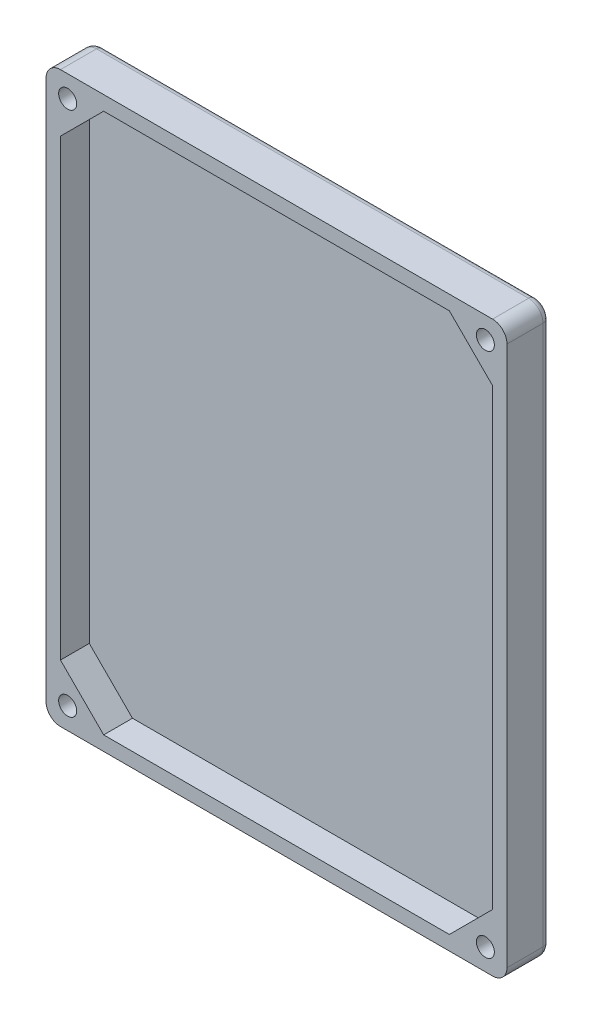
ISO-10303-21;
HEADER;
FILE_DESCRIPTION(('STEP AP214'),'2;1');
FILE_NAME('part.step','',(''),(''),'','','');
FILE_SCHEMA(('AUTOMOTIVE_DESIGN { 1 0 10303 214 1 1 1 1 }'));
ENDSEC;
DATA;
#1=APPLICATION_CONTEXT('core data for automotive mechanical design processes');
#2=APPLICATION_PROTOCOL_DEFINITION('international standard','automotive_design',2000,#1);
#3=PRODUCT_CONTEXT('',#1,'mechanical');
#4=PRODUCT('Part','Part','',(#3));
#5=PRODUCT_RELATED_PRODUCT_CATEGORY('part','',(#4));
#6=PRODUCT_DEFINITION_FORMATION('','',#4);
#7=PRODUCT_DEFINITION_CONTEXT('part definition',#1,'design');
#8=PRODUCT_DEFINITION('design','',#6,#7);
#9=PRODUCT_DEFINITION_SHAPE('','',#8);
#10=(LENGTH_UNIT() NAMED_UNIT(*) SI_UNIT(.MILLI.,.METRE.));
#11=(NAMED_UNIT(*) PLANE_ANGLE_UNIT() SI_UNIT($,.RADIAN.));
#12=(NAMED_UNIT(*) SI_UNIT($,.STERADIAN.) SOLID_ANGLE_UNIT());
#13=UNCERTAINTY_MEASURE_WITH_UNIT(LENGTH_MEASURE(1.E-05),#10,'distance_accuracy_value','');
#14=(GEOMETRIC_REPRESENTATION_CONTEXT(3) GLOBAL_UNCERTAINTY_ASSIGNED_CONTEXT((#13)) GLOBAL_UNIT_ASSIGNED_CONTEXT((#10,
#11,#12)) REPRESENTATION_CONTEXT('',''));
#15=CARTESIAN_POINT('',(0.,0.,0.));
#16=DIRECTION('',(0.,0.,1.));
#17=DIRECTION('',(1.,0.,0.));
#18=AXIS2_PLACEMENT_3D('',#15,#16,#17);
#19=CARTESIAN_POINT('',(0.,-38.5,1.));
#20=DIRECTION('',(-1.,0.,0.));
#21=DIRECTION('',(0.,0.,1.));
#22=AXIS2_PLACEMENT_3D('',#19,#20,#21);
#23=CYLINDRICAL_SURFACE('',#22,1.);
#24=CARTESIAN_POINT('',(-30.,-38.5,1.));
#25=DIRECTION('',(-1.,0.,0.));
#26=DIRECTION('',(0.,0.,1.));
#27=AXIS2_PLACEMENT_3D('',#24,#25,#26);
#28=CIRCLE('',#27,1.);
#29=CARTESIAN_POINT('',(-30.,-38.5,0.));
#30=VERTEX_POINT('',#29);
#31=CARTESIAN_POINT('',(-30.,-39.5,1.));
#32=VERTEX_POINT('',#31);
#33=EDGE_CURVE('E11',#30,#32,#28,.T.);
#34=ORIENTED_EDGE('',*,*,#33,.F.);
#35=DIRECTION('',(-1.,0.,0.));
#36=VECTOR('',#35,1.);
#37=CARTESIAN_POINT('',(0.,-38.5,0.));
#38=LINE('',#37,#36);
#39=CARTESIAN_POINT('',(-29.,-38.5,0.));
#40=VERTEX_POINT('',#39);
#41=EDGE_CURVE('E306',#40,#30,#38,.T.);
#42=ORIENTED_EDGE('',*,*,#41,.F.);
#43=DIRECTION('',(-1.,0.,0.));
#44=VECTOR('',#43,1.);
#45=CARTESIAN_POINT('',(0.,-38.5,0.));
#46=LINE('',#45,#44);
#47=CARTESIAN_POINT('',(29.,-38.5,0.));
#48=VERTEX_POINT('',#47);
#49=EDGE_CURVE('E309',#48,#40,#46,.T.);
#50=ORIENTED_EDGE('',*,*,#49,.F.);
#51=DIRECTION('',(-1.,0.,0.));
#52=VECTOR('',#51,1.);
#53=CARTESIAN_POINT('',(0.,-38.5,0.));
#54=LINE('',#53,#52);
#55=CARTESIAN_POINT('',(30.,-38.5,0.));
#56=VERTEX_POINT('',#55);
#57=EDGE_CURVE('E311',#56,#48,#54,.T.);
#58=ORIENTED_EDGE('',*,*,#57,.F.);
#59=CARTESIAN_POINT('',(30.,-38.5,1.));
#60=DIRECTION('',(-1.,0.,0.));
#61=DIRECTION('',(0.,0.,1.));
#62=AXIS2_PLACEMENT_3D('',#59,#60,#61);
#63=CIRCLE('',#62,1.);
#64=CARTESIAN_POINT('',(30.,-39.5,1.));
#65=VERTEX_POINT('',#64);
#66=EDGE_CURVE('E40',#56,#65,#63,.T.);
#67=ORIENTED_EDGE('',*,*,#66,.T.);
#68=DIRECTION('',(-1.,0.,0.));
#69=VECTOR('',#68,1.);
#70=CARTESIAN_POINT('',(32.,-39.5,1.));
#71=LINE('',#70,#69);
#72=EDGE_CURVE('E366',#32,#65,#71,.F.);
#73=ORIENTED_EDGE('',*,*,#72,.F.);
#74=EDGE_LOOP('',(#34,#42,#50,#58,#67,#73));
#75=FACE_BOUND('',#74,.T.);
#76=ADVANCED_FACE('F33',(#75),#23,.T.);
#77=CARTESIAN_POINT('',(30.,-37.5,1.));
#78=DIRECTION('',(0.,0.,1.));
#79=DIRECTION('',(1.,0.,0.));
#80=AXIS2_PLACEMENT_3D('',#77,#78,#79);
#81=DEGENERATE_TOROIDAL_SURFACE('',#80,1.,1.,.T.);
#82=ORIENTED_EDGE('',*,*,#66,.F.);
#83=CARTESIAN_POINT('',(30.,-37.5,0.));
#84=DIRECTION('',(0.,0.,1.));
#85=DIRECTION('',(1.,0.,0.));
#86=AXIS2_PLACEMENT_3D('',#83,#84,#85);
#87=CIRCLE('',#86,1.);
#88=CARTESIAN_POINT('',(31.,-37.5,0.));
#89=VERTEX_POINT('',#88);
#90=EDGE_CURVE('E313',#89,#56,#87,.F.);
#91=ORIENTED_EDGE('',*,*,#90,.F.);
#92=CARTESIAN_POINT('',(31.,-37.5,1.));
#93=DIRECTION('',(0.,-1.,0.));
#94=DIRECTION('',(0.,0.,-1.));
#95=AXIS2_PLACEMENT_3D('',#92,#93,#94);
#96=CIRCLE('',#95,1.);
#97=CARTESIAN_POINT('',(32.,-37.5,1.));
#98=VERTEX_POINT('',#97);
#99=EDGE_CURVE('E54',#89,#98,#96,.T.);
#100=ORIENTED_EDGE('',*,*,#99,.T.);
#101=CARTESIAN_POINT('',(30.,-37.5,1.));
#102=DIRECTION('',(0.,0.,1.));
#103=DIRECTION('',(1.,0.,0.));
#104=AXIS2_PLACEMENT_3D('',#101,#102,#103);
#105=CIRCLE('',#104,2.);
#106=EDGE_CURVE('E364',#65,#98,#105,.T.);
#107=ORIENTED_EDGE('',*,*,#106,.F.);
#108=EDGE_LOOP('',(#82,#91,#100,#107));
#109=FACE_BOUND('',#108,.T.);
#110=ADVANCED_FACE('F404',(#109),#81,.T.);
#111=CARTESIAN_POINT('',(31.,0.,1.));
#112=DIRECTION('',(0.,-1.,0.));
#113=DIRECTION('',(0.,0.,-1.));
#114=AXIS2_PLACEMENT_3D('',#111,#112,#113);
#115=CYLINDRICAL_SURFACE('',#114,1.);
#116=ORIENTED_EDGE('',*,*,#99,.F.);
#117=DIRECTION('',(0.,-1.,0.));
#118=VECTOR('',#117,1.);
#119=CARTESIAN_POINT('',(31.,0.,0.));
#120=LINE('',#119,#118);
#121=CARTESIAN_POINT('',(31.,-36.5,0.));
#122=VERTEX_POINT('',#121);
#123=EDGE_CURVE('E316',#122,#89,#120,.T.);
#124=ORIENTED_EDGE('',*,*,#123,.F.);
#125=DIRECTION('',(0.,-1.,0.));
#126=VECTOR('',#125,1.);
#127=CARTESIAN_POINT('',(31.,0.,0.));
#128=LINE('',#127,#126);
#129=CARTESIAN_POINT('',(31.,36.5,0.));
#130=VERTEX_POINT('',#129);
#131=EDGE_CURVE('E319',#130,#122,#128,.T.);
#132=ORIENTED_EDGE('',*,*,#131,.F.);
#133=DIRECTION('',(0.,-1.,0.));
#134=VECTOR('',#133,1.);
#135=CARTESIAN_POINT('',(31.,0.,0.));
#136=LINE('',#135,#134);
#137=CARTESIAN_POINT('',(31.,37.5,0.));
#138=VERTEX_POINT('',#137);
#139=EDGE_CURVE('E321',#138,#130,#136,.T.);
#140=ORIENTED_EDGE('',*,*,#139,.F.);
#141=CARTESIAN_POINT('',(31.,37.5,1.));
#142=DIRECTION('',(0.,-1.,0.));
#143=DIRECTION('',(0.,0.,-1.));
#144=AXIS2_PLACEMENT_3D('',#141,#142,#143);
#145=CIRCLE('',#144,1.);
#146=CARTESIAN_POINT('',(32.,37.5,1.));
#147=VERTEX_POINT('',#146);
#148=EDGE_CURVE('E376',#138,#147,#145,.T.);
#149=ORIENTED_EDGE('',*,*,#148,.T.);
#150=DIRECTION('',(0.,-1.,0.));
#151=VECTOR('',#150,1.);
#152=CARTESIAN_POINT('',(32.,-39.5,1.));
#153=LINE('',#152,#151);
#154=EDGE_CURVE('E361',#98,#147,#153,.F.);
#155=ORIENTED_EDGE('',*,*,#154,.F.);
#156=EDGE_LOOP('',(#116,#124,#132,#140,#149,#155));
#157=FACE_BOUND('',#156,.T.);
#158=ADVANCED_FACE('F381',(#157),#115,.T.);
#159=CARTESIAN_POINT('',(30.,37.5,1.));
#160=DIRECTION('',(0.,0.,1.));
#161=DIRECTION('',(1.,0.,0.));
#162=AXIS2_PLACEMENT_3D('',#159,#160,#161);
#163=DEGENERATE_TOROIDAL_SURFACE('',#162,1.,1.,.T.);
#164=ORIENTED_EDGE('',*,*,#148,.F.);
#165=CARTESIAN_POINT('',(30.,37.5,0.));
#166=DIRECTION('',(0.,0.,1.));
#167=DIRECTION('',(1.,0.,0.));
#168=AXIS2_PLACEMENT_3D('',#165,#166,#167);
#169=CIRCLE('',#168,1.);
#170=CARTESIAN_POINT('',(30.,38.5,0.));
#171=VERTEX_POINT('',#170);
#172=EDGE_CURVE('E323',#171,#138,#169,.F.);
#173=ORIENTED_EDGE('',*,*,#172,.F.);
#174=CARTESIAN_POINT('',(30.,38.5,1.));
#175=DIRECTION('',(1.,0.,0.));
#176=DIRECTION('',(0.,0.,-1.));
#177=AXIS2_PLACEMENT_3D('',#174,#175,#176);
#178=CIRCLE('',#177,1.);
#179=CARTESIAN_POINT('',(30.,39.5,1.));
#180=VERTEX_POINT('',#179);
#181=EDGE_CURVE('E374',#171,#180,#178,.T.);
#182=ORIENTED_EDGE('',*,*,#181,.T.);
#183=CARTESIAN_POINT('',(30.,37.5,1.));
#184=DIRECTION('',(0.,0.,1.));
#185=DIRECTION('',(1.,0.,0.));
#186=AXIS2_PLACEMENT_3D('',#183,#184,#185);
#187=CIRCLE('',#186,2.);
#188=EDGE_CURVE('E358',#147,#180,#187,.T.);
#189=ORIENTED_EDGE('',*,*,#188,.F.);
#190=EDGE_LOOP('',(#164,#173,#182,#189));
#191=FACE_BOUND('',#190,.T.);
#192=ADVANCED_FACE('F392',(#191),#163,.T.);
#193=CARTESIAN_POINT('',(0.,38.5,1.));
#194=DIRECTION('',(1.,0.,0.));
#195=DIRECTION('',(0.,1.,0.));
#196=AXIS2_PLACEMENT_3D('',#193,#194,#195);
#197=CYLINDRICAL_SURFACE('',#196,1.);
#198=ORIENTED_EDGE('',*,*,#181,.F.);
#199=DIRECTION('',(1.,0.,0.));
#200=VECTOR('',#199,1.);
#201=CARTESIAN_POINT('',(0.,38.5,0.));
#202=LINE('',#201,#200);
#203=CARTESIAN_POINT('',(29.,38.5,0.));
#204=VERTEX_POINT('',#203);
#205=EDGE_CURVE('E326',#204,#171,#202,.T.);
#206=ORIENTED_EDGE('',*,*,#205,.F.);
#207=DIRECTION('',(1.,0.,0.));
#208=VECTOR('',#207,1.);
#209=CARTESIAN_POINT('',(0.,38.5,0.));
#210=LINE('',#209,#208);
#211=CARTESIAN_POINT('',(-29.,38.5,0.));
#212=VERTEX_POINT('',#211);
#213=EDGE_CURVE('E329',#212,#204,#210,.T.);
#214=ORIENTED_EDGE('',*,*,#213,.F.);
#215=DIRECTION('',(1.,0.,0.));
#216=VECTOR('',#215,1.);
#217=CARTESIAN_POINT('',(0.,38.5,0.));
#218=LINE('',#217,#216);
#219=CARTESIAN_POINT('',(-30.,38.5,0.));
#220=VERTEX_POINT('',#219);
#221=EDGE_CURVE('E331',#220,#212,#218,.T.);
#222=ORIENTED_EDGE('',*,*,#221,.F.);
#223=CARTESIAN_POINT('',(-30.,38.5,1.));
#224=DIRECTION('',(1.,0.,0.));
#225=DIRECTION('',(0.,0.,-1.));
#226=AXIS2_PLACEMENT_3D('',#223,#224,#225);
#227=CIRCLE('',#226,1.);
#228=CARTESIAN_POINT('',(-30.,39.5,1.));
#229=VERTEX_POINT('',#228);
#230=EDGE_CURVE('E372',#220,#229,#227,.T.);
#231=ORIENTED_EDGE('',*,*,#230,.T.);
#232=DIRECTION('',(1.,0.,0.));
#233=VECTOR('',#232,1.);
#234=CARTESIAN_POINT('',(32.,39.5,1.));
#235=LINE('',#234,#233);
#236=EDGE_CURVE('E355',#180,#229,#235,.F.);
#237=ORIENTED_EDGE('',*,*,#236,.F.);
#238=EDGE_LOOP('',(#198,#206,#214,#222,#231,#237));
#239=FACE_BOUND('',#238,.T.);
#240=ADVANCED_FACE('F515',(#239),#197,.T.);
#241=CARTESIAN_POINT('',(-30.,37.5,1.));
#242=DIRECTION('',(0.,0.,1.));
#243=DIRECTION('',(1.,0.,0.));
#244=AXIS2_PLACEMENT_3D('',#241,#242,#243);
#245=DEGENERATE_TOROIDAL_SURFACE('',#244,1.,1.,.T.);
#246=ORIENTED_EDGE('',*,*,#230,.F.);
#247=CARTESIAN_POINT('',(-30.,37.5,0.));
#248=DIRECTION('',(0.,0.,1.));
#249=DIRECTION('',(1.,0.,0.));
#250=AXIS2_PLACEMENT_3D('',#247,#248,#249);
#251=CIRCLE('',#250,1.);
#252=CARTESIAN_POINT('',(-31.,37.5,0.));
#253=VERTEX_POINT('',#252);
#254=EDGE_CURVE('E333',#253,#220,#251,.F.);
#255=ORIENTED_EDGE('',*,*,#254,.F.);
#256=CARTESIAN_POINT('',(-31.,37.5,1.));
#257=DIRECTION('',(0.,1.,0.));
#258=DIRECTION('',(0.,0.,1.));
#259=AXIS2_PLACEMENT_3D('',#256,#257,#258);
#260=CIRCLE('',#259,1.);
#261=CARTESIAN_POINT('',(-32.,37.5,1.));
#262=VERTEX_POINT('',#261);
#263=EDGE_CURVE('E370',#253,#262,#260,.T.);
#264=ORIENTED_EDGE('',*,*,#263,.T.);
#265=CARTESIAN_POINT('',(-30.,37.5,1.));
#266=DIRECTION('',(0.,0.,1.));
#267=DIRECTION('',(1.,0.,0.));
#268=AXIS2_PLACEMENT_3D('',#265,#266,#267);
#269=CIRCLE('',#268,2.);
#270=EDGE_CURVE('E352',#229,#262,#269,.T.);
#271=ORIENTED_EDGE('',*,*,#270,.F.);
#272=EDGE_LOOP('',(#246,#255,#264,#271));
#273=FACE_BOUND('',#272,.T.);
#274=ADVANCED_FACE('F518',(#273),#245,.T.);
#275=CARTESIAN_POINT('',(-31.,0.,1.));
#276=DIRECTION('',(0.,1.,0.));
#277=DIRECTION('',(0.,0.,1.));
#278=AXIS2_PLACEMENT_3D('',#275,#276,#277);
#279=CYLINDRICAL_SURFACE('',#278,1.);
#280=ORIENTED_EDGE('',*,*,#263,.F.);
#281=DIRECTION('',(0.,1.,0.));
#282=VECTOR('',#281,1.);
#283=CARTESIAN_POINT('',(-31.,0.,0.));
#284=LINE('',#283,#282);
#285=CARTESIAN_POINT('',(-31.,36.5,0.));
#286=VERTEX_POINT('',#285);
#287=EDGE_CURVE('E336',#286,#253,#284,.T.);
#288=ORIENTED_EDGE('',*,*,#287,.F.);
#289=DIRECTION('',(0.,1.,0.));
#290=VECTOR('',#289,1.);
#291=CARTESIAN_POINT('',(-31.,0.,0.));
#292=LINE('',#291,#290);
#293=CARTESIAN_POINT('',(-31.,-36.5,0.));
#294=VERTEX_POINT('',#293);
#295=EDGE_CURVE('E339',#294,#286,#292,.T.);
#296=ORIENTED_EDGE('',*,*,#295,.F.);
#297=DIRECTION('',(0.,1.,0.));
#298=VECTOR('',#297,1.);
#299=CARTESIAN_POINT('',(-31.,0.,0.));
#300=LINE('',#299,#298);
#301=CARTESIAN_POINT('',(-31.,-37.5,0.));
#302=VERTEX_POINT('',#301);
#303=EDGE_CURVE('E341',#302,#294,#300,.T.);
#304=ORIENTED_EDGE('',*,*,#303,.F.);
#305=CARTESIAN_POINT('',(-31.,-37.5,1.));
#306=DIRECTION('',(0.,1.,0.));
#307=DIRECTION('',(0.,0.,1.));
#308=AXIS2_PLACEMENT_3D('',#305,#306,#307);
#309=CIRCLE('',#308,1.);
#310=CARTESIAN_POINT('',(-32.,-37.5,1.));
#311=VERTEX_POINT('',#310);
#312=EDGE_CURVE('E368',#302,#311,#309,.T.);
#313=ORIENTED_EDGE('',*,*,#312,.T.);
#314=DIRECTION('',(0.,1.,0.));
#315=VECTOR('',#314,1.);
#316=CARTESIAN_POINT('',(-32.,-39.5,1.));
#317=LINE('',#316,#315);
#318=EDGE_CURVE('E349',#262,#311,#317,.F.);
#319=ORIENTED_EDGE('',*,*,#318,.F.);
#320=EDGE_LOOP('',(#280,#288,#296,#304,#313,#319));
#321=FACE_BOUND('',#320,.T.);
#322=ADVANCED_FACE('F522',(#321),#279,.T.);
#323=CARTESIAN_POINT('',(-30.,-37.5,1.));
#324=DIRECTION('',(0.,0.,1.));
#325=DIRECTION('',(1.,0.,0.));
#326=AXIS2_PLACEMENT_3D('',#323,#324,#325);
#327=DEGENERATE_TOROIDAL_SURFACE('',#326,1.,1.,.T.);
#328=CARTESIAN_POINT('',(-30.,-37.5,0.));
#329=DIRECTION('',(0.,0.,1.));
#330=DIRECTION('',(1.,0.,0.));
#331=AXIS2_PLACEMENT_3D('',#328,#329,#330);
#332=CIRCLE('',#331,1.);
#333=EDGE_CURVE('E343',#30,#302,#332,.F.);
#334=ORIENTED_EDGE('',*,*,#333,.F.);
#335=ORIENTED_EDGE('',*,*,#33,.T.);
#336=CARTESIAN_POINT('',(-30.,-37.5,1.));
#337=DIRECTION('',(0.,0.,1.));
#338=DIRECTION('',(1.,0.,0.));
#339=AXIS2_PLACEMENT_3D('',#336,#337,#338);
#340=CIRCLE('',#339,2.);
#341=EDGE_CURVE('E346',#311,#32,#340,.T.);
#342=ORIENTED_EDGE('',*,*,#341,.F.);
#343=ORIENTED_EDGE('',*,*,#312,.F.);
#344=EDGE_LOOP('',(#334,#335,#342,#343));
#345=FACE_BOUND('',#344,.T.);
#346=ADVANCED_FACE('F526',(#345),#327,.T.);
#347=CARTESIAN_POINT('',(0.,0.,0.));
#348=DIRECTION('',(0.,0.,1.));
#349=DIRECTION('',(1.,0.,0.));
#350=AXIS2_PLACEMENT_3D('',#347,#348,#349);
#351=PLANE('',#350);
#352=ORIENTED_EDGE('',*,*,#41,.T.);
#353=ORIENTED_EDGE('',*,*,#333,.T.);
#354=ORIENTED_EDGE('',*,*,#303,.T.);
#355=CARTESIAN_POINT('',(-29.,-36.5,0.));
#356=DIRECTION('',(0.,0.,-1.));
#357=DIRECTION('',(-1.,0.,0.));
#358=AXIS2_PLACEMENT_3D('',#355,#356,#357);
#359=CIRCLE('',#358,2.);
#360=EDGE_CURVE('E427',#40,#294,#359,.T.);
#361=ORIENTED_EDGE('',*,*,#360,.F.);
#362=EDGE_LOOP('',(#352,#353,#354,#361));
#363=FACE_BOUND('',#362,.T.);
#364=ADVANCED_FACE('F530',(#363),#351,.F.);
#365=EDGE_CURVE('E447',#294,#40,#359,.T.);
#366=ORIENTED_EDGE('',*,*,#365,.F.);
#367=ORIENTED_EDGE('',*,*,#295,.T.);
#368=CARTESIAN_POINT('',(-29.,36.5,0.));
#369=DIRECTION('',(0.,0.,-1.));
#370=DIRECTION('',(-1.,0.,0.));
#371=AXIS2_PLACEMENT_3D('',#368,#369,#370);
#372=CIRCLE('',#371,2.00000000000001);
#373=EDGE_CURVE('E440',#212,#286,#372,.T.);
#374=ORIENTED_EDGE('',*,*,#373,.F.);
#375=ORIENTED_EDGE('',*,*,#213,.T.);
#376=CARTESIAN_POINT('',(29.,36.5,0.));
#377=DIRECTION('',(0.,0.,-1.));
#378=DIRECTION('',(-1.,0.,0.));
#379=AXIS2_PLACEMENT_3D('',#376,#377,#378);
#380=CIRCLE('',#379,2.);
#381=EDGE_CURVE('E436',#130,#204,#380,.T.);
#382=ORIENTED_EDGE('',*,*,#381,.F.);
#383=ORIENTED_EDGE('',*,*,#131,.T.);
#384=CARTESIAN_POINT('',(29.,-36.5,0.));
#385=DIRECTION('',(0.,0.,-1.));
#386=DIRECTION('',(-1.,0.,0.));
#387=AXIS2_PLACEMENT_3D('',#384,#385,#386);
#388=CIRCLE('',#387,2.);
#389=EDGE_CURVE('E416',#48,#122,#388,.T.);
#390=ORIENTED_EDGE('',*,*,#389,.F.);
#391=ORIENTED_EDGE('',*,*,#49,.T.);
#392=EDGE_LOOP('',(#366,#367,#374,#375,#382,#383,#390,#391));
#393=FACE_BOUND('',#392,.T.);
#394=ADVANCED_FACE('F418',(#393),#351,.F.);
#395=EDGE_CURVE('E438',#286,#212,#372,.T.);
#396=ORIENTED_EDGE('',*,*,#395,.F.);
#397=ORIENTED_EDGE('',*,*,#287,.T.);
#398=ORIENTED_EDGE('',*,*,#254,.T.);
#399=ORIENTED_EDGE('',*,*,#221,.T.);
#400=EDGE_LOOP('',(#396,#397,#398,#399));
#401=FACE_BOUND('',#400,.T.);
#402=ADVANCED_FACE('F713',(#401),#351,.F.);
#403=EDGE_CURVE('E433',#204,#130,#380,.T.);
#404=ORIENTED_EDGE('',*,*,#403,.F.);
#405=ORIENTED_EDGE('',*,*,#205,.T.);
#406=ORIENTED_EDGE('',*,*,#172,.T.);
#407=ORIENTED_EDGE('',*,*,#139,.T.);
#408=EDGE_LOOP('',(#404,#405,#406,#407));
#409=FACE_BOUND('',#408,.T.);
#410=ADVANCED_FACE('F535',(#409),#351,.F.);
#411=CARTESIAN_POINT('',(-30.,37.5,2.));
#412=DIRECTION('',(0.,0.,-1.));
#413=DIRECTION('',(-1.,0.,0.));
#414=AXIS2_PLACEMENT_3D('',#411,#412,#413);
#415=CYLINDRICAL_SURFACE('',#414,2.);
#416=DIRECTION('',(0.,0.,-1.));
#417=VECTOR('',#416,1.);
#418=CARTESIAN_POINT('',(-30.,39.5,2.));
#419=LINE('',#418,#417);
#420=CARTESIAN_POINT('',(-30.,39.5,6.));
#421=VERTEX_POINT('',#420);
#422=EDGE_CURVE('E302',#229,#421,#419,.F.);
#423=ORIENTED_EDGE('',*,*,#422,.F.);
#424=ORIENTED_EDGE('',*,*,#270,.T.);
#425=DIRECTION('',(0.,0.,-1.));
#426=VECTOR('',#425,1.);
#427=CARTESIAN_POINT('',(-32.,37.5,2.));
#428=LINE('',#427,#426);
#429=CARTESIAN_POINT('',(-32.,37.5,6.));
#430=VERTEX_POINT('',#429);
#431=EDGE_CURVE('E299',#430,#262,#428,.T.);
#432=ORIENTED_EDGE('',*,*,#431,.F.);
#433=CARTESIAN_POINT('',(-30.,37.5,6.));
#434=DIRECTION('',(0.,0.,1.));
#435=DIRECTION('',(1.,0.,0.));
#436=AXIS2_PLACEMENT_3D('',#433,#434,#435);
#437=CIRCLE('',#436,2.);
#438=EDGE_CURVE('E304',#421,#430,#437,.T.);
#439=ORIENTED_EDGE('',*,*,#438,.F.);
#440=EDGE_LOOP('',(#423,#424,#432,#439));
#441=FACE_BOUND('',#440,.T.);
#442=ADVANCED_FACE('F532',(#441),#415,.T.);
#443=CARTESIAN_POINT('',(30.,37.5,2.));
#444=DIRECTION('',(0.,0.,-1.));
#445=DIRECTION('',(-1.,0.,0.));
#446=AXIS2_PLACEMENT_3D('',#443,#444,#445);
#447=CYLINDRICAL_SURFACE('',#446,2.);
#448=DIRECTION('',(0.,0.,-1.));
#449=VECTOR('',#448,1.);
#450=CARTESIAN_POINT('',(32.,37.5,2.));
#451=LINE('',#450,#449);
#452=CARTESIAN_POINT('',(32.,37.5,6.));
#453=VERTEX_POINT('',#452);
#454=EDGE_CURVE('E295',#147,#453,#451,.F.);
#455=ORIENTED_EDGE('',*,*,#454,.F.);
#456=ORIENTED_EDGE('',*,*,#188,.T.);
#457=DIRECTION('',(0.,0.,-1.));
#458=VECTOR('',#457,1.);
#459=CARTESIAN_POINT('',(30.,39.5,2.));
#460=LINE('',#459,#458);
#461=CARTESIAN_POINT('',(30.,39.5,6.));
#462=VERTEX_POINT('',#461);
#463=EDGE_CURVE('E292',#462,#180,#460,.T.);
#464=ORIENTED_EDGE('',*,*,#463,.F.);
#465=CARTESIAN_POINT('',(30.,37.5,6.));
#466=DIRECTION('',(0.,0.,1.));
#467=DIRECTION('',(1.,0.,0.));
#468=AXIS2_PLACEMENT_3D('',#465,#466,#467);
#469=CIRCLE('',#468,2.);
#470=EDGE_CURVE('E297',#453,#462,#469,.T.);
#471=ORIENTED_EDGE('',*,*,#470,.F.);
#472=EDGE_LOOP('',(#455,#456,#464,#471));
#473=FACE_BOUND('',#472,.T.);
#474=ADVANCED_FACE('F396',(#473),#447,.T.);
#475=CARTESIAN_POINT('',(30.,-37.5,2.));
#476=DIRECTION('',(0.,0.,1.));
#477=DIRECTION('',(1.,0.,0.));
#478=AXIS2_PLACEMENT_3D('',#475,#476,#477);
#479=CYLINDRICAL_SURFACE('',#478,2.);
#480=DIRECTION('',(0.,0.,1.));
#481=VECTOR('',#480,1.);
#482=CARTESIAN_POINT('',(30.,-39.5,2.));
#483=LINE('',#482,#481);
#484=CARTESIAN_POINT('',(30.,-39.5,6.));
#485=VERTEX_POINT('',#484);
#486=EDGE_CURVE('E285',#65,#485,#483,.T.);
#487=ORIENTED_EDGE('',*,*,#486,.F.);
#488=ORIENTED_EDGE('',*,*,#106,.T.);
#489=DIRECTION('',(0.,0.,1.));
#490=VECTOR('',#489,1.);
#491=CARTESIAN_POINT('',(32.,-37.5,2.));
#492=LINE('',#491,#490);
#493=CARTESIAN_POINT('',(32.,-37.5,6.));
#494=VERTEX_POINT('',#493);
#495=EDGE_CURVE('E287',#494,#98,#492,.F.);
#496=ORIENTED_EDGE('',*,*,#495,.F.);
#497=CARTESIAN_POINT('',(30.,-37.5,6.));
#498=DIRECTION('',(0.,0.,1.));
#499=DIRECTION('',(1.,0.,0.));
#500=AXIS2_PLACEMENT_3D('',#497,#498,#499);
#501=CIRCLE('',#500,2.);
#502=EDGE_CURVE('E290',#485,#494,#501,.T.);
#503=ORIENTED_EDGE('',*,*,#502,.F.);
#504=EDGE_LOOP('',(#487,#488,#496,#503));
#505=FACE_BOUND('',#504,.T.);
#506=ADVANCED_FACE('F403',(#505),#479,.T.);
#507=CARTESIAN_POINT('',(-30.,-37.5,2.));
#508=DIRECTION('',(0.,0.,-1.));
#509=DIRECTION('',(-1.,0.,0.));
#510=AXIS2_PLACEMENT_3D('',#507,#508,#509);
#511=CYLINDRICAL_SURFACE('',#510,2.);
#512=DIRECTION('',(0.,0.,-1.));
#513=VECTOR('',#512,1.);
#514=CARTESIAN_POINT('',(-32.,-37.5,2.));
#515=LINE('',#514,#513);
#516=CARTESIAN_POINT('',(-32.,-37.5,6.));
#517=VERTEX_POINT('',#516);
#518=EDGE_CURVE('E281',#311,#517,#515,.F.);
#519=ORIENTED_EDGE('',*,*,#518,.F.);
#520=ORIENTED_EDGE('',*,*,#341,.T.);
#521=DIRECTION('',(0.,0.,-1.));
#522=VECTOR('',#521,1.);
#523=CARTESIAN_POINT('',(-30.,-39.5,2.));
#524=LINE('',#523,#522);
#525=CARTESIAN_POINT('',(-30.,-39.5,6.));
#526=VERTEX_POINT('',#525);
#527=EDGE_CURVE('E278',#526,#32,#524,.T.);
#528=ORIENTED_EDGE('',*,*,#527,.F.);
#529=CARTESIAN_POINT('',(-30.,-37.5,6.));
#530=DIRECTION('',(0.,0.,1.));
#531=DIRECTION('',(1.,0.,0.));
#532=AXIS2_PLACEMENT_3D('',#529,#530,#531);
#533=CIRCLE('',#532,2.);
#534=EDGE_CURVE('E283',#517,#526,#533,.T.);
#535=ORIENTED_EDGE('',*,*,#534,.F.);
#536=EDGE_LOOP('',(#519,#520,#528,#535));
#537=FACE_BOUND('',#536,.T.);
#538=ADVANCED_FACE('F541',(#537),#511,.T.);
#539=CARTESIAN_POINT('',(-32.,-39.5,2.));
#540=DIRECTION('',(1.,0.,0.));
#541=DIRECTION('',(0.,0.,-1.));
#542=AXIS2_PLACEMENT_3D('',#539,#540,#541);
#543=PLANE('',#542);
#544=ORIENTED_EDGE('',*,*,#431,.T.);
#545=ORIENTED_EDGE('',*,*,#318,.T.);
#546=ORIENTED_EDGE('',*,*,#518,.T.);
#547=DIRECTION('',(0.,-1.,0.));
#548=VECTOR('',#547,1.);
#549=CARTESIAN_POINT('',(-32.,-39.5,6.));
#550=LINE('',#549,#548);
#551=EDGE_CURVE('E213',#430,#517,#550,.T.);
#552=ORIENTED_EDGE('',*,*,#551,.F.);
#553=EDGE_LOOP('',(#544,#545,#546,#552));
#554=FACE_BOUND('',#553,.T.);
#555=ADVANCED_FACE('F544',(#554),#543,.F.);
#556=CARTESIAN_POINT('',(32.,-39.5,2.));
#557=DIRECTION('',(0.,1.,0.));
#558=DIRECTION('',(0.,0.,1.));
#559=AXIS2_PLACEMENT_3D('',#556,#557,#558);
#560=PLANE('',#559);
#561=ORIENTED_EDGE('',*,*,#527,.T.);
#562=ORIENTED_EDGE('',*,*,#72,.T.);
#563=ORIENTED_EDGE('',*,*,#486,.T.);
#564=DIRECTION('',(1.,0.,0.));
#565=VECTOR('',#564,1.);
#566=CARTESIAN_POINT('',(32.,-39.5,6.));
#567=LINE('',#566,#565);
#568=EDGE_CURVE('E269',#526,#485,#567,.T.);
#569=ORIENTED_EDGE('',*,*,#568,.F.);
#570=EDGE_LOOP('',(#561,#562,#563,#569));
#571=FACE_BOUND('',#570,.T.);
#572=ADVANCED_FACE('F548',(#571),#560,.F.);
#573=CARTESIAN_POINT('',(32.,-39.5,2.));
#574=DIRECTION('',(-1.,0.,0.));
#575=DIRECTION('',(0.,0.,1.));
#576=AXIS2_PLACEMENT_3D('',#573,#574,#575);
#577=PLANE('',#576);
#578=ORIENTED_EDGE('',*,*,#495,.T.);
#579=ORIENTED_EDGE('',*,*,#154,.T.);
#580=ORIENTED_EDGE('',*,*,#454,.T.);
#581=DIRECTION('',(0.,1.,0.));
#582=VECTOR('',#581,1.);
#583=CARTESIAN_POINT('',(32.,-39.5,6.));
#584=LINE('',#583,#582);
#585=EDGE_CURVE('E272',#494,#453,#584,.T.);
#586=ORIENTED_EDGE('',*,*,#585,.F.);
#587=EDGE_LOOP('',(#578,#579,#580,#586));
#588=FACE_BOUND('',#587,.T.);
#589=ADVANCED_FACE('F387',(#588),#577,.F.);
#590=CARTESIAN_POINT('',(32.,39.5,2.));
#591=DIRECTION('',(0.,-1.,0.));
#592=DIRECTION('',(1.,0.,0.));
#593=AXIS2_PLACEMENT_3D('',#590,#591,#592);
#594=PLANE('',#593);
#595=ORIENTED_EDGE('',*,*,#463,.T.);
#596=ORIENTED_EDGE('',*,*,#236,.T.);
#597=ORIENTED_EDGE('',*,*,#422,.T.);
#598=DIRECTION('',(-1.,0.,0.));
#599=VECTOR('',#598,1.);
#600=CARTESIAN_POINT('',(32.,39.5,6.));
#601=LINE('',#600,#599);
#602=EDGE_CURVE('E275',#462,#421,#601,.T.);
#603=ORIENTED_EDGE('',*,*,#602,.F.);
#604=EDGE_LOOP('',(#595,#596,#597,#603));
#605=FACE_BOUND('',#604,.T.);
#606=ADVANCED_FACE('F555',(#605),#594,.F.);
#607=EDGE_CURVE('E421',#122,#48,#388,.T.);
#608=ORIENTED_EDGE('',*,*,#607,.F.);
#609=ORIENTED_EDGE('',*,*,#123,.T.);
#610=ORIENTED_EDGE('',*,*,#90,.T.);
#611=ORIENTED_EDGE('',*,*,#57,.T.);
#612=EDGE_LOOP('',(#608,#609,#610,#611));
#613=FACE_BOUND('',#612,.T.);
#614=ADVANCED_FACE('F407',(#613),#351,.F.);
#615=CARTESIAN_POINT('',(0.,0.,6.));
#616=DIRECTION('',(0.,0.,1.));
#617=DIRECTION('',(1.,0.,0.));
#618=AXIS2_PLACEMENT_3D('',#615,#616,#617);
#619=PLANE('',#618);
#620=CARTESIAN_POINT('',(29.,36.5,6.));
#621=DIRECTION('',(0.,0.,-1.));
#622=DIRECTION('',(-1.,0.,0.));
#623=AXIS2_PLACEMENT_3D('',#620,#621,#622);
#624=CIRCLE('',#623,1.25);
#625=CARTESIAN_POINT('',(27.75,36.5,6.));
#626=VERTEX_POINT('',#625);
#627=EDGE_CURVE('E463',#626,#626,#624,.T.);
#628=ORIENTED_EDGE('',*,*,#627,.T.);
#629=EDGE_LOOP('',(#628));
#630=FACE_BOUND('',#629,.T.);
#631=CARTESIAN_POINT('',(29.,-36.5,6.));
#632=DIRECTION('',(0.,0.,-1.));
#633=DIRECTION('',(-1.,0.,0.));
#634=AXIS2_PLACEMENT_3D('',#631,#632,#633);
#635=CIRCLE('',#634,1.25);
#636=CARTESIAN_POINT('',(27.75,-36.5,6.));
#637=VERTEX_POINT('',#636);
#638=EDGE_CURVE('E469',#637,#637,#635,.T.);
#639=ORIENTED_EDGE('',*,*,#638,.T.);
#640=EDGE_LOOP('',(#639));
#641=FACE_BOUND('',#640,.T.);
#642=CARTESIAN_POINT('',(-29.,-36.5,6.));
#643=DIRECTION('',(0.,0.,-1.));
#644=DIRECTION('',(-1.,0.,0.));
#645=AXIS2_PLACEMENT_3D('',#642,#643,#644);
#646=CIRCLE('',#645,1.25);
#647=CARTESIAN_POINT('',(-30.25,-36.5,6.));
#648=VERTEX_POINT('',#647);
#649=EDGE_CURVE('E457',#648,#648,#646,.T.);
#650=ORIENTED_EDGE('',*,*,#649,.T.);
#651=EDGE_LOOP('',(#650));
#652=FACE_BOUND('',#651,.T.);
#653=CARTESIAN_POINT('',(-29.,36.5,6.));
#654=DIRECTION('',(0.,0.,-1.));
#655=DIRECTION('',(-1.,0.,0.));
#656=AXIS2_PLACEMENT_3D('',#653,#654,#655);
#657=CIRCLE('',#656,1.25);
#658=CARTESIAN_POINT('',(-30.25,36.5,6.));
#659=VERTEX_POINT('',#658);
#660=EDGE_CURVE('E456',#659,#659,#657,.T.);
#661=ORIENTED_EDGE('',*,*,#660,.T.);
#662=EDGE_LOOP('',(#661));
#663=FACE_BOUND('',#662,.T.);
#664=ORIENTED_EDGE('',*,*,#602,.T.);
#665=ORIENTED_EDGE('',*,*,#438,.T.);
#666=ORIENTED_EDGE('',*,*,#551,.T.);
#667=ORIENTED_EDGE('',*,*,#534,.T.);
#668=ORIENTED_EDGE('',*,*,#568,.T.);
#669=ORIENTED_EDGE('',*,*,#502,.T.);
#670=ORIENTED_EDGE('',*,*,#585,.T.);
#671=ORIENTED_EDGE('',*,*,#470,.T.);
#672=EDGE_LOOP('',(#664,#665,#666,#667,#668,#669,#670,#671));
#673=FACE_BOUND('',#672,.T.);
#674=DIRECTION('',(0.707106781186548,-0.707106781186548,0.));
#675=VECTOR('',#674,1.);
#676=CARTESIAN_POINT('',(-30.,-31.5,6.));
#677=LINE('',#676,#675);
#678=CARTESIAN_POINT('',(-30.,-31.5,6.));
#679=VERTEX_POINT('',#678);
#680=CARTESIAN_POINT('',(-24.,-37.5,6.));
#681=VERTEX_POINT('',#680);
#682=EDGE_CURVE('E204',#679,#681,#677,.T.);
#683=ORIENTED_EDGE('',*,*,#682,.F.);
#684=DIRECTION('',(0.,-1.,0.));
#685=VECTOR('',#684,1.);
#686=CARTESIAN_POINT('',(-30.,-31.5,6.));
#687=LINE('',#686,#685);
#688=CARTESIAN_POINT('',(-30.,31.5,6.));
#689=VERTEX_POINT('',#688);
#690=EDGE_CURVE('E194',#689,#679,#687,.T.);
#691=ORIENTED_EDGE('',*,*,#690,.F.);
#692=DIRECTION('',(-0.707106781186548,-0.707106781186548,0.));
#693=VECTOR('',#692,1.);
#694=CARTESIAN_POINT('',(-30.,31.5,6.));
#695=LINE('',#694,#693);
#696=CARTESIAN_POINT('',(-24.,37.5,6.));
#697=VERTEX_POINT('',#696);
#698=EDGE_CURVE('E233',#697,#689,#695,.T.);
#699=ORIENTED_EDGE('',*,*,#698,.F.);
#700=DIRECTION('',(-1.,0.,0.));
#701=VECTOR('',#700,1.);
#702=CARTESIAN_POINT('',(24.,37.5,6.));
#703=LINE('',#702,#701);
#704=CARTESIAN_POINT('',(24.,37.5,6.));
#705=VERTEX_POINT('',#704);
#706=EDGE_CURVE('E230',#705,#697,#703,.T.);
#707=ORIENTED_EDGE('',*,*,#706,.F.);
#708=DIRECTION('',(-0.707106781186548,0.707106781186548,0.));
#709=VECTOR('',#708,1.);
#710=CARTESIAN_POINT('',(30.,31.5,6.));
#711=LINE('',#710,#709);
#712=CARTESIAN_POINT('',(30.,31.5,6.));
#713=VERTEX_POINT('',#712);
#714=EDGE_CURVE('E228',#713,#705,#711,.T.);
#715=ORIENTED_EDGE('',*,*,#714,.F.);
#716=DIRECTION('',(0.,1.,0.));
#717=VECTOR('',#716,1.);
#718=CARTESIAN_POINT('',(30.,-31.5,6.));
#719=LINE('',#718,#717);
#720=CARTESIAN_POINT('',(30.,-31.5,6.));
#721=VERTEX_POINT('',#720);
#722=EDGE_CURVE('E226',#721,#713,#719,.T.);
#723=ORIENTED_EDGE('',*,*,#722,.F.);
#724=DIRECTION('',(0.707106781186548,0.707106781186548,0.));
#725=VECTOR('',#724,1.);
#726=CARTESIAN_POINT('',(24.,-37.5,6.));
#727=LINE('',#726,#725);
#728=CARTESIAN_POINT('',(24.,-37.5,6.));
#729=VERTEX_POINT('',#728);
#730=EDGE_CURVE('E221',#729,#721,#727,.T.);
#731=ORIENTED_EDGE('',*,*,#730,.F.);
#732=DIRECTION('',(1.,0.,0.));
#733=VECTOR('',#732,1.);
#734=CARTESIAN_POINT('',(24.,-37.5,6.));
#735=LINE('',#734,#733);
#736=EDGE_CURVE('E219',#681,#729,#735,.T.);
#737=ORIENTED_EDGE('',*,*,#736,.F.);
#738=EDGE_LOOP('',(#683,#691,#699,#707,#715,#723,#731,#737));
#739=FACE_BOUND('',#738,.T.);
#740=ADVANCED_FACE('F217',(#630,#641,#652,#663,#673,#739),#619,.T.);
#741=CARTESIAN_POINT('',(-30.,-31.5,6.));
#742=DIRECTION('',(1.,0.,0.));
#743=DIRECTION('',(0.,0.,-1.));
#744=AXIS2_PLACEMENT_3D('',#741,#742,#743);
#745=PLANE('',#744);
#746=DIRECTION('',(0.,-1.,0.));
#747=VECTOR('',#746,1.);
#748=CARTESIAN_POINT('',(-30.,-31.5,2.));
#749=LINE('',#748,#747);
#750=CARTESIAN_POINT('',(-30.,31.5,2.));
#751=VERTEX_POINT('',#750);
#752=CARTESIAN_POINT('',(-30.,-31.5,2.));
#753=VERTEX_POINT('',#752);
#754=EDGE_CURVE('E235',#751,#753,#749,.T.);
#755=ORIENTED_EDGE('',*,*,#754,.F.);
#756=DIRECTION('',(0.,0.,-1.));
#757=VECTOR('',#756,1.);
#758=CARTESIAN_POINT('',(-30.,31.5,6.));
#759=LINE('',#758,#757);
#760=EDGE_CURVE('E200',#689,#751,#759,.T.);
#761=ORIENTED_EDGE('',*,*,#760,.F.);
#762=ORIENTED_EDGE('',*,*,#690,.T.);
#763=DIRECTION('',(0.,0.,-1.));
#764=VECTOR('',#763,1.);
#765=CARTESIAN_POINT('',(-30.,-31.5,6.));
#766=LINE('',#765,#764);
#767=EDGE_CURVE('E198',#679,#753,#766,.T.);
#768=ORIENTED_EDGE('',*,*,#767,.T.);
#769=EDGE_LOOP('',(#755,#761,#762,#768));
#770=FACE_BOUND('',#769,.T.);
#771=ADVANCED_FACE('F197',(#770),#745,.T.);
#772=CARTESIAN_POINT('',(-30.,-31.5,6.));
#773=DIRECTION('',(0.707106781186547,0.707106781186547,0.));
#774=DIRECTION('',(-0.707106781186548,0.707106781186548,0.));
#775=AXIS2_PLACEMENT_3D('',#772,#773,#774);
#776=PLANE('',#775);
#777=DIRECTION('',(0.707106781186548,-0.707106781186548,0.));
#778=VECTOR('',#777,1.);
#779=CARTESIAN_POINT('',(-30.,-31.5,2.));
#780=LINE('',#779,#778);
#781=CARTESIAN_POINT('',(-24.,-37.5,2.));
#782=VERTEX_POINT('',#781);
#783=EDGE_CURVE('E212',#753,#782,#780,.T.);
#784=ORIENTED_EDGE('',*,*,#783,.F.);
#785=ORIENTED_EDGE('',*,*,#767,.F.);
#786=ORIENTED_EDGE('',*,*,#682,.T.);
#787=DIRECTION('',(0.,0.,-1.));
#788=VECTOR('',#787,1.);
#789=CARTESIAN_POINT('',(-24.,-37.5,6.));
#790=LINE('',#789,#788);
#791=EDGE_CURVE('E214',#681,#782,#790,.T.);
#792=ORIENTED_EDGE('',*,*,#791,.T.);
#793=EDGE_LOOP('',(#784,#785,#786,#792));
#794=FACE_BOUND('',#793,.T.);
#795=ADVANCED_FACE('F209',(#794),#776,.T.);
#796=CARTESIAN_POINT('',(24.,-37.5,6.));
#797=DIRECTION('',(0.,1.,0.));
#798=DIRECTION('',(0.,0.,1.));
#799=AXIS2_PLACEMENT_3D('',#796,#797,#798);
#800=PLANE('',#799);
#801=DIRECTION('',(1.,0.,0.));
#802=VECTOR('',#801,1.);
#803=CARTESIAN_POINT('',(24.,-37.5,2.));
#804=LINE('',#803,#802);
#805=CARTESIAN_POINT('',(24.,-37.5,2.));
#806=VERTEX_POINT('',#805);
#807=EDGE_CURVE('E239',#782,#806,#804,.T.);
#808=ORIENTED_EDGE('',*,*,#807,.F.);
#809=ORIENTED_EDGE('',*,*,#791,.F.);
#810=ORIENTED_EDGE('',*,*,#736,.T.);
#811=DIRECTION('',(0.,0.,-1.));
#812=VECTOR('',#811,1.);
#813=CARTESIAN_POINT('',(24.,-37.5,6.));
#814=LINE('',#813,#812);
#815=EDGE_CURVE('E263',#729,#806,#814,.T.);
#816=ORIENTED_EDGE('',*,*,#815,.T.);
#817=EDGE_LOOP('',(#808,#809,#810,#816));
#818=FACE_BOUND('',#817,.T.);
#819=ADVANCED_FACE('F574',(#818),#800,.T.);
#820=CARTESIAN_POINT('',(24.,-37.5,6.));
#821=DIRECTION('',(-0.707106781186547,0.707106781186547,0.));
#822=DIRECTION('',(-0.707106781186548,-0.707106781186548,0.));
#823=AXIS2_PLACEMENT_3D('',#820,#821,#822);
#824=PLANE('',#823);
#825=DIRECTION('',(0.707106781186548,0.707106781186548,0.));
#826=VECTOR('',#825,1.);
#827=CARTESIAN_POINT('',(24.,-37.5,2.));
#828=LINE('',#827,#826);
#829=CARTESIAN_POINT('',(30.,-31.5,2.));
#830=VERTEX_POINT('',#829);
#831=EDGE_CURVE('E241',#806,#830,#828,.T.);
#832=ORIENTED_EDGE('',*,*,#831,.F.);
#833=ORIENTED_EDGE('',*,*,#815,.F.);
#834=ORIENTED_EDGE('',*,*,#730,.T.);
#835=DIRECTION('',(0.,0.,-1.));
#836=VECTOR('',#835,1.);
#837=CARTESIAN_POINT('',(30.,-31.5,6.));
#838=LINE('',#837,#836);
#839=EDGE_CURVE('E260',#721,#830,#838,.T.);
#840=ORIENTED_EDGE('',*,*,#839,.T.);
#841=EDGE_LOOP('',(#832,#833,#834,#840));
#842=FACE_BOUND('',#841,.T.);
#843=ADVANCED_FACE('F577',(#842),#824,.T.);
#844=CARTESIAN_POINT('',(30.,-31.5,6.));
#845=DIRECTION('',(-1.,0.,0.));
#846=DIRECTION('',(0.,0.,1.));
#847=AXIS2_PLACEMENT_3D('',#844,#845,#846);
#848=PLANE('',#847);
#849=DIRECTION('',(0.,1.,0.));
#850=VECTOR('',#849,1.);
#851=CARTESIAN_POINT('',(30.,-31.5,2.));
#852=LINE('',#851,#850);
#853=CARTESIAN_POINT('',(30.,31.5,2.));
#854=VERTEX_POINT('',#853);
#855=EDGE_CURVE('E243',#830,#854,#852,.T.);
#856=ORIENTED_EDGE('',*,*,#855,.F.);
#857=ORIENTED_EDGE('',*,*,#839,.F.);
#858=ORIENTED_EDGE('',*,*,#722,.T.);
#859=DIRECTION('',(0.,0.,-1.));
#860=VECTOR('',#859,1.);
#861=CARTESIAN_POINT('',(30.,31.5,6.));
#862=LINE('',#861,#860);
#863=EDGE_CURVE('E257',#713,#854,#862,.T.);
#864=ORIENTED_EDGE('',*,*,#863,.T.);
#865=EDGE_LOOP('',(#856,#857,#858,#864));
#866=FACE_BOUND('',#865,.T.);
#867=ADVANCED_FACE('F581',(#866),#848,.T.);
#868=CARTESIAN_POINT('',(30.,31.5,6.));
#869=DIRECTION('',(-0.707106781186547,-0.707106781186547,0.));
#870=DIRECTION('',(0.707106781186548,-0.707106781186548,0.));
#871=AXIS2_PLACEMENT_3D('',#868,#869,#870);
#872=PLANE('',#871);
#873=DIRECTION('',(-0.707106781186548,0.707106781186548,0.));
#874=VECTOR('',#873,1.);
#875=CARTESIAN_POINT('',(30.,31.5,2.));
#876=LINE('',#875,#874);
#877=CARTESIAN_POINT('',(24.,37.5,2.));
#878=VERTEX_POINT('',#877);
#879=EDGE_CURVE('E245',#854,#878,#876,.T.);
#880=ORIENTED_EDGE('',*,*,#879,.F.);
#881=ORIENTED_EDGE('',*,*,#863,.F.);
#882=ORIENTED_EDGE('',*,*,#714,.T.);
#883=DIRECTION('',(0.,0.,-1.));
#884=VECTOR('',#883,1.);
#885=CARTESIAN_POINT('',(24.,37.5,6.));
#886=LINE('',#885,#884);
#887=EDGE_CURVE('E254',#705,#878,#886,.T.);
#888=ORIENTED_EDGE('',*,*,#887,.T.);
#889=EDGE_LOOP('',(#880,#881,#882,#888));
#890=FACE_BOUND('',#889,.T.);
#891=ADVANCED_FACE('F585',(#890),#872,.T.);
#892=CARTESIAN_POINT('',(24.,37.5,6.));
#893=DIRECTION('',(0.,-1.,0.));
#894=DIRECTION('',(0.,0.,-1.));
#895=AXIS2_PLACEMENT_3D('',#892,#893,#894);
#896=PLANE('',#895);
#897=DIRECTION('',(-1.,0.,0.));
#898=VECTOR('',#897,1.);
#899=CARTESIAN_POINT('',(24.,37.5,2.));
#900=LINE('',#899,#898);
#901=CARTESIAN_POINT('',(-24.,37.5,2.));
#902=VERTEX_POINT('',#901);
#903=EDGE_CURVE('E247',#878,#902,#900,.T.);
#904=ORIENTED_EDGE('',*,*,#903,.F.);
#905=ORIENTED_EDGE('',*,*,#887,.F.);
#906=ORIENTED_EDGE('',*,*,#706,.T.);
#907=DIRECTION('',(0.,0.,-1.));
#908=VECTOR('',#907,1.);
#909=CARTESIAN_POINT('',(-24.,37.5,6.));
#910=LINE('',#909,#908);
#911=EDGE_CURVE('E251',#697,#902,#910,.T.);
#912=ORIENTED_EDGE('',*,*,#911,.T.);
#913=EDGE_LOOP('',(#904,#905,#906,#912));
#914=FACE_BOUND('',#913,.T.);
#915=ADVANCED_FACE('F589',(#914),#896,.T.);
#916=CARTESIAN_POINT('',(-30.,31.5,6.));
#917=DIRECTION('',(0.707106781186547,-0.707106781186547,0.));
#918=DIRECTION('',(0.707106781186548,0.707106781186548,0.));
#919=AXIS2_PLACEMENT_3D('',#916,#917,#918);
#920=PLANE('',#919);
#921=DIRECTION('',(-0.707106781186548,-0.707106781186548,0.));
#922=VECTOR('',#921,1.);
#923=CARTESIAN_POINT('',(-30.,31.5,2.));
#924=LINE('',#923,#922);
#925=EDGE_CURVE('E205',#902,#751,#924,.T.);
#926=ORIENTED_EDGE('',*,*,#925,.F.);
#927=ORIENTED_EDGE('',*,*,#911,.F.);
#928=ORIENTED_EDGE('',*,*,#698,.T.);
#929=ORIENTED_EDGE('',*,*,#760,.T.);
#930=EDGE_LOOP('',(#926,#927,#928,#929));
#931=FACE_BOUND('',#930,.T.);
#932=ADVANCED_FACE('F565',(#931),#920,.T.);
#933=CARTESIAN_POINT('',(0.,0.,2.));
#934=DIRECTION('',(0.,0.,1.));
#935=DIRECTION('',(1.,0.,0.));
#936=AXIS2_PLACEMENT_3D('',#933,#934,#935);
#937=PLANE('',#936);
#938=ORIENTED_EDGE('',*,*,#754,.T.);
#939=ORIENTED_EDGE('',*,*,#783,.T.);
#940=ORIENTED_EDGE('',*,*,#807,.T.);
#941=ORIENTED_EDGE('',*,*,#831,.T.);
#942=ORIENTED_EDGE('',*,*,#855,.T.);
#943=ORIENTED_EDGE('',*,*,#879,.T.);
#944=ORIENTED_EDGE('',*,*,#903,.T.);
#945=ORIENTED_EDGE('',*,*,#925,.T.);
#946=EDGE_LOOP('',(#938,#939,#940,#941,#942,#943,#944,#945));
#947=FACE_BOUND('',#946,.T.);
#948=ADVANCED_FACE('F561',(#947),#937,.T.);
#949=CARTESIAN_POINT('',(-29.,36.5,2.));
#950=DIRECTION('',(0.,0.,-1.));
#951=DIRECTION('',(-1.,0.,0.));
#952=AXIS2_PLACEMENT_3D('',#949,#950,#951);
#953=CYLINDRICAL_SURFACE('',#952,2.00000000000001);
#954=CARTESIAN_POINT('',(-29.,36.5,2.));
#955=DIRECTION('',(0.,0.,-1.));
#956=DIRECTION('',(-1.,0.,0.));
#957=AXIS2_PLACEMENT_3D('',#954,#955,#956);
#958=CIRCLE('',#957,2.00000000000001);
#959=CARTESIAN_POINT('',(-31.,36.5,2.));
#960=VERTEX_POINT('',#959);
#961=EDGE_CURVE('E237',#960,#960,#958,.T.);
#962=ORIENTED_EDGE('',*,*,#961,.F.);
#963=EDGE_LOOP('',(#962));
#964=FACE_BOUND('',#963,.T.);
#965=ORIENTED_EDGE('',*,*,#395,.T.);
#966=ORIENTED_EDGE('',*,*,#373,.T.);
#967=EDGE_LOOP('',(#965,#966));
#968=FACE_BOUND('',#967,.T.);
#969=ADVANCED_FACE('F564',(#964,#968),#953,.F.);
#970=CARTESIAN_POINT('',(-29.,36.5,2.));
#971=DIRECTION('',(0.,0.,-1.));
#972=DIRECTION('',(-1.,0.,0.));
#973=AXIS2_PLACEMENT_3D('',#970,#971,#972);
#974=PLANE('',#973);
#975=CARTESIAN_POINT('',(-29.,36.5,2.));
#976=DIRECTION('',(0.,0.,-1.));
#977=DIRECTION('',(-1.,0.,0.));
#978=AXIS2_PLACEMENT_3D('',#975,#976,#977);
#979=CIRCLE('',#978,1.25);
#980=CARTESIAN_POINT('',(-30.25,36.5,2.));
#981=VERTEX_POINT('',#980);
#982=EDGE_CURVE('E453',#981,#981,#979,.T.);
#983=ORIENTED_EDGE('',*,*,#982,.F.);
#984=EDGE_LOOP('',(#983));
#985=FACE_BOUND('',#984,.T.);
#986=ORIENTED_EDGE('',*,*,#961,.T.);
#987=EDGE_LOOP('',(#986));
#988=FACE_BOUND('',#987,.T.);
#989=ADVANCED_FACE('F499',(#985,#988),#974,.T.);
#990=CARTESIAN_POINT('',(-29.,-36.5,2.));
#991=DIRECTION('',(0.,0.,-1.));
#992=DIRECTION('',(-1.,0.,0.));
#993=AXIS2_PLACEMENT_3D('',#990,#991,#992);
#994=CYLINDRICAL_SURFACE('',#993,2.);
#995=CARTESIAN_POINT('',(-29.,-36.5,2.));
#996=DIRECTION('',(0.,0.,-1.));
#997=DIRECTION('',(-1.,0.,0.));
#998=AXIS2_PLACEMENT_3D('',#995,#996,#997);
#999=CIRCLE('',#998,2.);
#1000=CARTESIAN_POINT('',(-31.,-36.5,2.));
#1001=VERTEX_POINT('',#1000);
#1002=EDGE_CURVE('E444',#1001,#1001,#999,.T.);
#1003=ORIENTED_EDGE('',*,*,#1002,.F.);
#1004=EDGE_LOOP('',(#1003));
#1005=FACE_BOUND('',#1004,.T.);
#1006=ORIENTED_EDGE('',*,*,#365,.T.);
#1007=ORIENTED_EDGE('',*,*,#360,.T.);
#1008=EDGE_LOOP('',(#1006,#1007));
#1009=FACE_BOUND('',#1008,.T.);
#1010=ADVANCED_FACE('F490',(#1005,#1009),#994,.F.);
#1011=CARTESIAN_POINT('',(-29.,-36.5,2.));
#1012=DIRECTION('',(0.,0.,-1.));
#1013=DIRECTION('',(-1.,0.,0.));
#1014=AXIS2_PLACEMENT_3D('',#1011,#1012,#1013);
#1015=PLANE('',#1014);
#1016=CARTESIAN_POINT('',(-29.,-36.5,2.));
#1017=DIRECTION('',(0.,0.,-1.));
#1018=DIRECTION('',(-1.,0.,0.));
#1019=AXIS2_PLACEMENT_3D('',#1016,#1017,#1018);
#1020=CIRCLE('',#1019,1.25);
#1021=CARTESIAN_POINT('',(-30.25,-36.5,2.));
#1022=VERTEX_POINT('',#1021);
#1023=EDGE_CURVE('E472',#1022,#1022,#1020,.T.);
#1024=ORIENTED_EDGE('',*,*,#1023,.F.);
#1025=EDGE_LOOP('',(#1024));
#1026=FACE_BOUND('',#1025,.T.);
#1027=ORIENTED_EDGE('',*,*,#1002,.T.);
#1028=EDGE_LOOP('',(#1027));
#1029=FACE_BOUND('',#1028,.T.);
#1030=ADVANCED_FACE('F488',(#1026,#1029),#1015,.T.);
#1031=CARTESIAN_POINT('',(29.,-36.5,2.));
#1032=DIRECTION('',(0.,0.,-1.));
#1033=DIRECTION('',(-1.,0.,0.));
#1034=AXIS2_PLACEMENT_3D('',#1031,#1032,#1033);
#1035=CYLINDRICAL_SURFACE('',#1034,2.);
#1036=CARTESIAN_POINT('',(29.,-36.5,2.));
#1037=DIRECTION('',(0.,0.,-1.));
#1038=DIRECTION('',(-1.,0.,0.));
#1039=AXIS2_PLACEMENT_3D('',#1036,#1037,#1038);
#1040=CIRCLE('',#1039,2.);
#1041=CARTESIAN_POINT('',(27.,-36.5,2.));
#1042=VERTEX_POINT('',#1041);
#1043=EDGE_CURVE('E425',#1042,#1042,#1040,.T.);
#1044=ORIENTED_EDGE('',*,*,#1043,.F.);
#1045=EDGE_LOOP('',(#1044));
#1046=FACE_BOUND('',#1045,.T.);
#1047=ORIENTED_EDGE('',*,*,#607,.T.);
#1048=ORIENTED_EDGE('',*,*,#389,.T.);
#1049=EDGE_LOOP('',(#1047,#1048));
#1050=FACE_BOUND('',#1049,.T.);
#1051=ADVANCED_FACE('F424',(#1046,#1050),#1035,.F.);
#1052=CARTESIAN_POINT('',(29.,-36.5,2.));
#1053=DIRECTION('',(0.,0.,-1.));
#1054=DIRECTION('',(-1.,0.,0.));
#1055=AXIS2_PLACEMENT_3D('',#1052,#1053,#1054);
#1056=PLANE('',#1055);
#1057=CARTESIAN_POINT('',(29.,-36.5,2.));
#1058=DIRECTION('',(0.,0.,-1.));
#1059=DIRECTION('',(-1.,0.,0.));
#1060=AXIS2_PLACEMENT_3D('',#1057,#1058,#1059);
#1061=CIRCLE('',#1060,1.25);
#1062=CARTESIAN_POINT('',(27.75,-36.5,2.));
#1063=VERTEX_POINT('',#1062);
#1064=EDGE_CURVE('E466',#1063,#1063,#1061,.T.);
#1065=ORIENTED_EDGE('',*,*,#1064,.F.);
#1066=EDGE_LOOP('',(#1065));
#1067=FACE_BOUND('',#1066,.T.);
#1068=ORIENTED_EDGE('',*,*,#1043,.T.);
#1069=EDGE_LOOP('',(#1068));
#1070=FACE_BOUND('',#1069,.T.);
#1071=ADVANCED_FACE('F496',(#1067,#1070),#1056,.T.);
#1072=CARTESIAN_POINT('',(29.,36.5,2.));
#1073=DIRECTION('',(0.,0.,-1.));
#1074=DIRECTION('',(-1.,0.,0.));
#1075=AXIS2_PLACEMENT_3D('',#1072,#1073,#1074);
#1076=CYLINDRICAL_SURFACE('',#1075,2.);
#1077=CARTESIAN_POINT('',(29.,36.5,2.));
#1078=DIRECTION('',(0.,0.,-1.));
#1079=DIRECTION('',(-1.,0.,0.));
#1080=AXIS2_PLACEMENT_3D('',#1077,#1078,#1079);
#1081=CIRCLE('',#1080,2.);
#1082=CARTESIAN_POINT('',(27.,36.5,2.));
#1083=VERTEX_POINT('',#1082);
#1084=EDGE_CURVE('E422',#1083,#1083,#1081,.T.);
#1085=ORIENTED_EDGE('',*,*,#1084,.F.);
#1086=EDGE_LOOP('',(#1085));
#1087=FACE_BOUND('',#1086,.T.);
#1088=ORIENTED_EDGE('',*,*,#403,.T.);
#1089=ORIENTED_EDGE('',*,*,#381,.T.);
#1090=EDGE_LOOP('',(#1088,#1089));
#1091=FACE_BOUND('',#1090,.T.);
#1092=ADVANCED_FACE('F603',(#1087,#1091),#1076,.F.);
#1093=CARTESIAN_POINT('',(29.,36.5,2.));
#1094=DIRECTION('',(0.,0.,-1.));
#1095=DIRECTION('',(-1.,0.,0.));
#1096=AXIS2_PLACEMENT_3D('',#1093,#1094,#1095);
#1097=PLANE('',#1096);
#1098=CARTESIAN_POINT('',(29.,36.5,2.));
#1099=DIRECTION('',(0.,0.,-1.));
#1100=DIRECTION('',(-1.,0.,0.));
#1101=AXIS2_PLACEMENT_3D('',#1098,#1099,#1100);
#1102=CIRCLE('',#1101,1.25);
#1103=CARTESIAN_POINT('',(27.75,36.5,2.));
#1104=VERTEX_POINT('',#1103);
#1105=EDGE_CURVE('E460',#1104,#1104,#1102,.T.);
#1106=ORIENTED_EDGE('',*,*,#1105,.F.);
#1107=EDGE_LOOP('',(#1106));
#1108=FACE_BOUND('',#1107,.T.);
#1109=ORIENTED_EDGE('',*,*,#1084,.T.);
#1110=EDGE_LOOP('',(#1109));
#1111=FACE_BOUND('',#1110,.T.);
#1112=ADVANCED_FACE('F606',(#1108,#1111),#1097,.T.);
#1113=CARTESIAN_POINT('',(-29.,36.5,6.));
#1114=DIRECTION('',(0.,0.,-1.));
#1115=DIRECTION('',(-1.,0.,0.));
#1116=AXIS2_PLACEMENT_3D('',#1113,#1114,#1115);
#1117=CYLINDRICAL_SURFACE('',#1116,1.25);
#1118=ORIENTED_EDGE('',*,*,#660,.F.);
#1119=EDGE_LOOP('',(#1118));
#1120=FACE_BOUND('',#1119,.T.);
#1121=ORIENTED_EDGE('',*,*,#982,.T.);
#1122=EDGE_LOOP('',(#1121));
#1123=FACE_BOUND('',#1122,.T.);
#1124=ADVANCED_FACE('F484',(#1120,#1123),#1117,.F.);
#1125=CARTESIAN_POINT('',(-29.,-36.5,6.));
#1126=DIRECTION('',(0.,0.,-1.));
#1127=DIRECTION('',(-1.,0.,0.));
#1128=AXIS2_PLACEMENT_3D('',#1125,#1126,#1127);
#1129=CYLINDRICAL_SURFACE('',#1128,1.25);
#1130=ORIENTED_EDGE('',*,*,#649,.F.);
#1131=EDGE_LOOP('',(#1130));
#1132=FACE_BOUND('',#1131,.T.);
#1133=ORIENTED_EDGE('',*,*,#1023,.T.);
#1134=EDGE_LOOP('',(#1133));
#1135=FACE_BOUND('',#1134,.T.);
#1136=ADVANCED_FACE('F480',(#1132,#1135),#1129,.F.);
#1137=CARTESIAN_POINT('',(29.,-36.5,6.));
#1138=DIRECTION('',(0.,0.,-1.));
#1139=DIRECTION('',(-1.,0.,0.));
#1140=AXIS2_PLACEMENT_3D('',#1137,#1138,#1139);
#1141=CYLINDRICAL_SURFACE('',#1140,1.25);
#1142=ORIENTED_EDGE('',*,*,#638,.F.);
#1143=EDGE_LOOP('',(#1142));
#1144=FACE_BOUND('',#1143,.T.);
#1145=ORIENTED_EDGE('',*,*,#1064,.T.);
#1146=EDGE_LOOP('',(#1145));
#1147=FACE_BOUND('',#1146,.T.);
#1148=ADVANCED_FACE('F483',(#1144,#1147),#1141,.F.);
#1149=CARTESIAN_POINT('',(29.,36.5,6.));
#1150=DIRECTION('',(0.,0.,-1.));
#1151=DIRECTION('',(-1.,0.,0.));
#1152=AXIS2_PLACEMENT_3D('',#1149,#1150,#1151);
#1153=CYLINDRICAL_SURFACE('',#1152,1.25);
#1154=ORIENTED_EDGE('',*,*,#627,.F.);
#1155=EDGE_LOOP('',(#1154));
#1156=FACE_BOUND('',#1155,.T.);
#1157=ORIENTED_EDGE('',*,*,#1105,.T.);
#1158=EDGE_LOOP('',(#1157));
#1159=FACE_BOUND('',#1158,.T.);
#1160=ADVANCED_FACE('F620',(#1156,#1159),#1153,.F.);
#1161=CLOSED_SHELL('',(#76,#110,#158,#192,#240,#274,#322,#346,#364,#394,#402,#410,#442,#474,
#506,#538,#555,#572,#589,#606,#614,#740,#771,#795,#819,#843,#867,#891,#915,#932,#948,#969,#989,
#1010,#1030,#1051,#1071,#1092,#1112,#1124,#1136,#1148,#1160));
#1162=MANIFOLD_SOLID_BREP('B2',#1161);
#1163=ADVANCED_BREP_SHAPE_REPRESENTATION('',(#18,#1162),#14);
#1164=SHAPE_DEFINITION_REPRESENTATION(#9,#1163);
ENDSEC;
END-ISO-10303-21;
